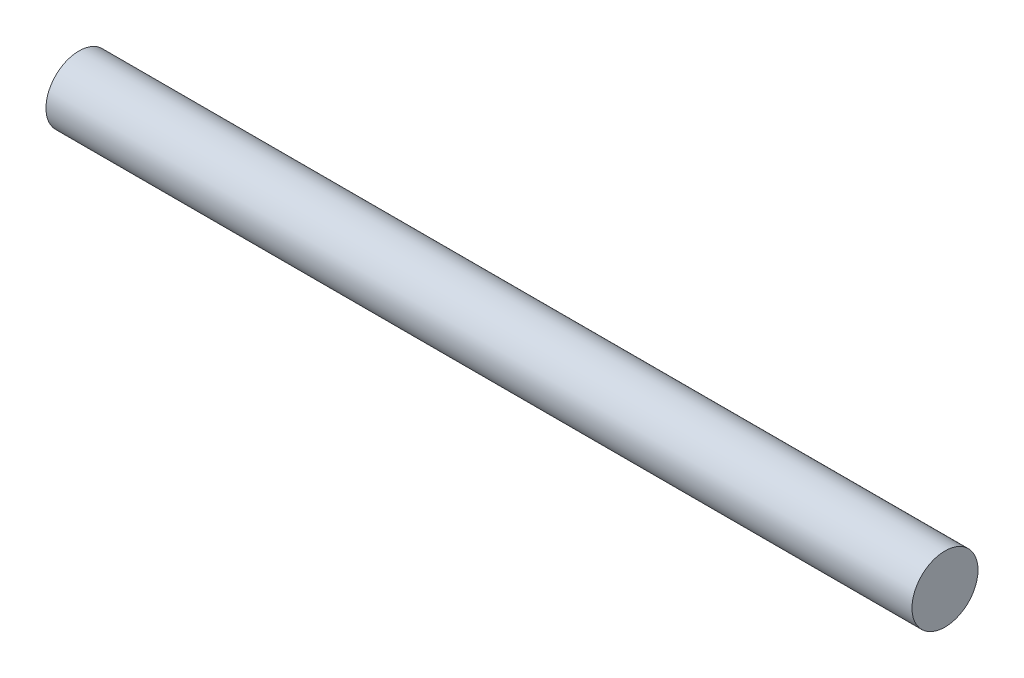
ISO-10303-21;
HEADER;
FILE_DESCRIPTION(('STEP AP214'),'2;1');
FILE_NAME('part.step','',(''),(''),'','','');
FILE_SCHEMA(('AUTOMOTIVE_DESIGN { 1 0 10303 214 1 1 1 1 }'));
ENDSEC;
DATA;
#1=APPLICATION_CONTEXT('core data for automotive mechanical design processes');
#2=APPLICATION_PROTOCOL_DEFINITION('international standard','automotive_design',2000,#1);
#3=PRODUCT_CONTEXT('',#1,'mechanical');
#4=PRODUCT('Part','Part','',(#3));
#5=PRODUCT_RELATED_PRODUCT_CATEGORY('part','',(#4));
#6=PRODUCT_DEFINITION_FORMATION('','',#4);
#7=PRODUCT_DEFINITION_CONTEXT('part definition',#1,'design');
#8=PRODUCT_DEFINITION('design','',#6,#7);
#9=PRODUCT_DEFINITION_SHAPE('','',#8);
#10=(LENGTH_UNIT() NAMED_UNIT(*) SI_UNIT(.MILLI.,.METRE.));
#11=(NAMED_UNIT(*) PLANE_ANGLE_UNIT() SI_UNIT($,.RADIAN.));
#12=(NAMED_UNIT(*) SI_UNIT($,.STERADIAN.) SOLID_ANGLE_UNIT());
#13=UNCERTAINTY_MEASURE_WITH_UNIT(LENGTH_MEASURE(1.E-05),#10,'distance_accuracy_value','');
#14=(GEOMETRIC_REPRESENTATION_CONTEXT(3) GLOBAL_UNCERTAINTY_ASSIGNED_CONTEXT((#13)) GLOBAL_UNIT_ASSIGNED_CONTEXT((#10,
#11,#12)) REPRESENTATION_CONTEXT('',''));
#15=CARTESIAN_POINT('',(0.,0.,0.));
#16=DIRECTION('',(0.,0.,1.));
#17=DIRECTION('',(1.,0.,0.));
#18=AXIS2_PLACEMENT_3D('',#15,#16,#17);
#19=CARTESIAN_POINT('',(-177.,0.,0.));
#20=DIRECTION('',(1.,0.,0.));
#21=DIRECTION('',(0.,0.,-1.));
#22=AXIS2_PLACEMENT_3D('',#19,#20,#21);
#23=CYLINDRICAL_SURFACE('',#22,13.5);
#24=CARTESIAN_POINT('',(-177.,0.,0.));
#25=DIRECTION('',(1.,0.,0.));
#26=DIRECTION('',(0.,0.,-1.));
#27=AXIS2_PLACEMENT_3D('',#24,#25,#26);
#28=CIRCLE('',#27,13.5);
#29=CARTESIAN_POINT('',(-177.,0.,-13.5));
#30=VERTEX_POINT('',#29);
#31=EDGE_CURVE('E10',#30,#30,#28,.T.);
#32=ORIENTED_EDGE('',*,*,#31,.T.);
#33=EDGE_LOOP('',(#32));
#34=FACE_BOUND('',#33,.T.);
#35=CARTESIAN_POINT('',(177.,0.,0.));
#36=DIRECTION('',(1.,0.,0.));
#37=DIRECTION('',(0.,0.,-1.));
#38=AXIS2_PLACEMENT_3D('',#35,#36,#37);
#39=CIRCLE('',#38,13.5);
#40=CARTESIAN_POINT('',(177.,0.,-13.5));
#41=VERTEX_POINT('',#40);
#42=EDGE_CURVE('E39',#41,#41,#39,.T.);
#43=ORIENTED_EDGE('',*,*,#42,.F.);
#44=EDGE_LOOP('',(#43));
#45=FACE_BOUND('',#44,.T.);
#46=ADVANCED_FACE('F33',(#34,#45),#23,.T.);
#47=CARTESIAN_POINT('',(-177.,0.,0.));
#48=DIRECTION('',(1.,0.,0.));
#49=DIRECTION('',(0.,0.,-1.));
#50=AXIS2_PLACEMENT_3D('',#47,#48,#49);
#51=PLANE('',#50);
#52=ORIENTED_EDGE('',*,*,#31,.F.);
#53=EDGE_LOOP('',(#52));
#54=FACE_BOUND('',#53,.T.);
#55=ADVANCED_FACE('F48',(#54),#51,.F.);
#56=CARTESIAN_POINT('',(177.,0.,0.));
#57=DIRECTION('',(1.,0.,0.));
#58=DIRECTION('',(0.,0.,-1.));
#59=AXIS2_PLACEMENT_3D('',#56,#57,#58);
#60=PLANE('',#59);
#61=ORIENTED_EDGE('',*,*,#42,.T.);
#62=EDGE_LOOP('',(#61));
#63=FACE_BOUND('',#62,.T.);
#64=ADVANCED_FACE('F45',(#63),#60,.T.);
#65=CLOSED_SHELL('',(#46,#55,#64));
#66=MANIFOLD_SOLID_BREP('B2',#65);
#67=ADVANCED_BREP_SHAPE_REPRESENTATION('',(#18,#66),#14);
#68=SHAPE_DEFINITION_REPRESENTATION(#9,#67);
ENDSEC;
END-ISO-10303-21;
